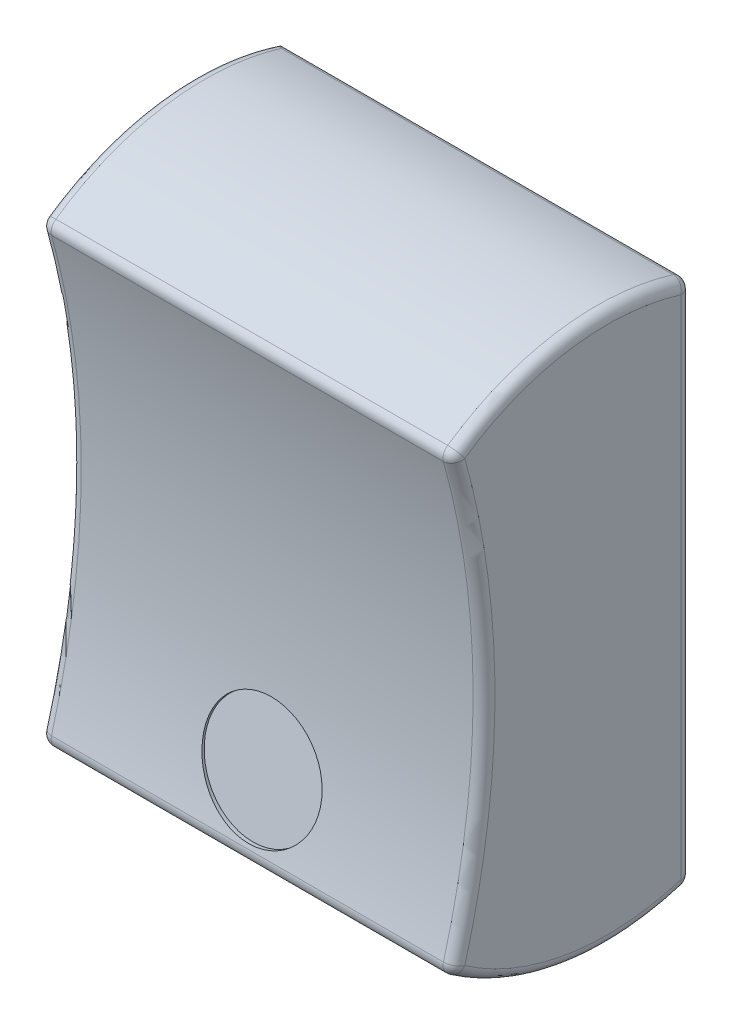
ISO-10303-21;
HEADER;
FILE_DESCRIPTION(('STEP AP214'),'2;1');
FILE_NAME('part.step','',(''),(''),'','','');
FILE_SCHEMA(('AUTOMOTIVE_DESIGN { 1 0 10303 214 1 1 1 1 }'));
ENDSEC;
DATA;
#1=APPLICATION_CONTEXT('core data for automotive mechanical design processes');
#2=APPLICATION_PROTOCOL_DEFINITION('international standard','automotive_design',2000,#1);
#3=PRODUCT_CONTEXT('',#1,'mechanical');
#4=PRODUCT('Part','Part','',(#3));
#5=PRODUCT_RELATED_PRODUCT_CATEGORY('part','',(#4));
#6=PRODUCT_DEFINITION_FORMATION('','',#4);
#7=PRODUCT_DEFINITION_CONTEXT('part definition',#1,'design');
#8=PRODUCT_DEFINITION('design','',#6,#7);
#9=PRODUCT_DEFINITION_SHAPE('','',#8);
#10=(LENGTH_UNIT() NAMED_UNIT(*) SI_UNIT(.MILLI.,.METRE.));
#11=(NAMED_UNIT(*) PLANE_ANGLE_UNIT() SI_UNIT($,.RADIAN.));
#12=(NAMED_UNIT(*) SI_UNIT($,.STERADIAN.) SOLID_ANGLE_UNIT());
#13=UNCERTAINTY_MEASURE_WITH_UNIT(LENGTH_MEASURE(1.E-05),#10,'distance_accuracy_value','');
#14=(GEOMETRIC_REPRESENTATION_CONTEXT(3) GLOBAL_UNCERTAINTY_ASSIGNED_CONTEXT((#13)) GLOBAL_UNIT_ASSIGNED_CONTEXT((#10,
#11,#12)) REPRESENTATION_CONTEXT('',''));
#15=CARTESIAN_POINT('',(0.,0.,0.));
#16=DIRECTION('',(0.,0.,1.));
#17=DIRECTION('',(1.,0.,0.));
#18=AXIS2_PLACEMENT_3D('',#15,#16,#17);
#19=CARTESIAN_POINT('',(9.5,0.,46.5403418666731));
#20=DIRECTION('',(-1.,0.,0.));
#21=DIRECTION('',(0.,0.,1.));
#22=AXIS2_PLACEMENT_3D('',#19,#20,#21);
#23=CYLINDRICAL_SURFACE('',#22,36.9999999999999);
#24=DIRECTION('',(-1.,0.,0.));
#25=VECTOR('',#24,1.);
#26=CARTESIAN_POINT('',(9.5,9.95392788031332,10.9044144933956));
#27=LINE('',#26,#25);
#28=CARTESIAN_POINT('',(9.,9.95392788031332,10.9044144933956));
#29=VERTEX_POINT('',#28);
#30=CARTESIAN_POINT('',(-9.,9.95392788031332,10.9044144933956));
#31=VERTEX_POINT('',#30);
#32=EDGE_CURVE('E257',#29,#31,#27,.T.);
#33=ORIENTED_EDGE('',*,*,#32,.T.);
#34=CARTESIAN_POINT('',(-9.,0.,46.5403418666731));
#35=DIRECTION('',(1.,0.,0.));
#36=DIRECTION('',(0.,0.,-1.));
#37=AXIS2_PLACEMENT_3D('',#34,#35,#36);
#38=CIRCLE('',#37,36.9999999999999);
#39=CARTESIAN_POINT('',(-9.,-9.95392788031332,10.9044144933956));
#40=VERTEX_POINT('',#39);
#41=EDGE_CURVE('E293',#31,#40,#38,.F.);
#42=ORIENTED_EDGE('',*,*,#41,.T.);
#43=DIRECTION('',(-1.,0.,0.));
#44=VECTOR('',#43,1.);
#45=CARTESIAN_POINT('',(9.5,-9.95392788031332,10.9044144933956));
#46=LINE('',#45,#44);
#47=CARTESIAN_POINT('',(9.,-9.95392788031332,10.9044144933956));
#48=VERTEX_POINT('',#47);
#49=EDGE_CURVE('E299',#40,#48,#46,.F.);
#50=ORIENTED_EDGE('',*,*,#49,.T.);
#51=CARTESIAN_POINT('',(9.,0.,46.5403418666731));
#52=DIRECTION('',(1.,0.,0.));
#53=DIRECTION('',(0.,0.,-1.));
#54=AXIS2_PLACEMENT_3D('',#51,#52,#53);
#55=CIRCLE('',#54,36.9999999999999);
#56=EDGE_CURVE('E304',#48,#29,#55,.T.);
#57=ORIENTED_EDGE('',*,*,#56,.T.);
#58=EDGE_LOOP('',(#33,#42,#50,#57));
#59=FACE_BOUND('',#58,.T.);
#60=CARTESIAN_POINT('',(0.,-4.44808845911152,9.80868645802175));
#61=CARTESIAN_POINT('',(-0.152015556943355,-4.44809525060015,9.80868644265864));
#62=CARTESIAN_POINT('',(-0.304136129508207,-4.46086310683319,9.81022644787345));
#63=CARTESIAN_POINT('',(-0.604173119909223,-4.51159644231174,9.81642424573123));
#64=CARTESIAN_POINT('',(-0.752084502984961,-4.54959087532301,9.82108562097456));
#65=CARTESIAN_POINT('',(-1.03931423980043,-4.64963307637608,9.83361988462219));
#66=CARTESIAN_POINT('',(-1.17863720982043,-4.71166778975028,9.84149103013613));
#67=CARTESIAN_POINT('',(-1.4447973719315,-4.85794009069451,9.8605677158941));
#68=CARTESIAN_POINT('',(-1.57163732934071,-4.9421727455575,9.87177251542275));
#69=CARTESIAN_POINT('',(-1.80951035033081,-5.13054299957085,9.89765425521252));
#70=CARTESIAN_POINT('',(-1.92051609474946,-5.23471429139984,9.91233708283358));
#71=CARTESIAN_POINT('',(-2.12333484463515,-5.45984269862248,9.94521880960401));
#72=CARTESIAN_POINT('',(-2.21514704445616,-5.58080051827359,9.96341785628446));
#73=CARTESIAN_POINT('',(-2.37705392123047,-5.83612943984643,10.00328834679));
#74=CARTESIAN_POINT('',(-2.44712685384906,-5.97051379499978,10.0249632346153));
#75=CARTESIAN_POINT('',(-2.56342543902181,-6.24871131515531,10.0715404477602));
#76=CARTESIAN_POINT('',(-2.60965142993638,-6.39252434634288,10.0964427272807));
#77=CARTESIAN_POINT('',(-2.67686360394062,-6.68516526709477,10.1489883155522));
#78=CARTESIAN_POINT('',(-2.69789573794512,-6.83398351622424,10.1766265342148));
#79=CARTESIAN_POINT('',(-2.714266959859,-7.13261990896966,10.2340221863179));
#80=CARTESIAN_POINT('',(-2.70960641390347,-7.28243803830636,10.2637795895529));
#81=CARTESIAN_POINT('',(-2.67476196822029,-7.5785401737478,10.3244815975073));
#82=CARTESIAN_POINT('',(-2.64462457457549,-7.72483012016232,10.3554239410169));
#83=CARTESIAN_POINT('',(-2.55975595999252,-8.01005191882634,10.4174905885844));
#84=CARTESIAN_POINT('',(-2.50502453211178,-8.14898370915083,10.4486148941712));
#85=CARTESIAN_POINT('',(-2.37245876691253,-8.41577647942333,10.5098897264812));
#86=CARTESIAN_POINT('',(-2.2945996195063,-8.54362537904411,10.5400391687165));
#87=CARTESIAN_POINT('',(-2.11800673361776,-8.78457026515896,10.5980727748488));
#88=CARTESIAN_POINT('',(-2.01927266330858,-8.89766601709142,10.6259569027266));
#89=CARTESIAN_POINT('',(-1.80345210296187,-9.10626516015082,10.678279005717));
#90=CARTESIAN_POINT('',(-1.68632251530952,-9.20172606301772,10.7027086254169));
#91=CARTESIAN_POINT('',(-1.43718606518732,-9.37210947287514,10.7468880471571));
#92=CARTESIAN_POINT('',(-1.30517920100864,-9.4470319775066,10.7666378486598));
#93=CARTESIAN_POINT('',(-1.03001894469917,-9.57428259063133,10.8004835898333));
#94=CARTESIAN_POINT('',(-0.886865570119078,-9.62661073469959,10.8145795384062));
#95=CARTESIAN_POINT('',(-0.593479470761656,-9.70722669783235,10.8363993784729));
#96=CARTESIAN_POINT('',(-0.443246866399587,-9.73551492565185,10.8441233783102));
#97=CARTESIAN_POINT('',(-0.140360394345807,-9.767227905553,10.8527875349199));
#98=CARTESIAN_POINT('',(0.01228664965757,-9.77071332363588,10.8537442439951));
#99=CARTESIAN_POINT('',(0.316014915337675,-9.75288475267661,10.848867799272));
#100=CARTESIAN_POINT('',(0.467096148819073,-9.73157095073358,10.8430346966997));
#101=CARTESIAN_POINT('',(0.763227850254708,-9.66477279669679,10.8248921282107));
#102=CARTESIAN_POINT('',(0.908285042253417,-9.61931621978623,10.8125901046597));
#103=CARTESIAN_POINT('',(1.18845885076849,-9.50549802910248,10.7821406031121));
#104=CARTESIAN_POINT('',(1.32357533984614,-9.43713612174786,10.7639930501927));
#105=CARTESIAN_POINT('',(1.58031667897601,-9.27922092876062,10.722710638141));
#106=CARTESIAN_POINT('',(1.70191517787422,-9.18962728370865,10.6995662881418));
#107=CARTESIAN_POINT('',(1.92790336612723,-8.99176249300466,10.6494154871162));
#108=CARTESIAN_POINT('',(2.0322928123963,-8.88349108356489,10.6224089815452));
#109=CARTESIAN_POINT('',(2.2211153458737,-8.65098822226591,10.5657018710021));
#110=CARTESIAN_POINT('',(2.30550730367577,-8.5267246746793,10.535995884485));
#111=CARTESIAN_POINT('',(2.45165844769029,-8.26583827416514,10.4752086664971));
#112=CARTESIAN_POINT('',(2.51341780499535,-8.1292155146776,10.4441274454244));
#113=CARTESIAN_POINT('',(2.61248645944786,-7.84754884156255,10.381847093604));
#114=CARTESIAN_POINT('',(2.64981849171264,-7.70251289559046,10.3506480997553));
#115=CARTESIAN_POINT('',(2.69904467209305,-7.40798883524168,10.2892133201758));
#116=CARTESIAN_POINT('',(2.7109391894394,-7.25850078552012,10.2589775204703));
#117=CARTESIAN_POINT('',(2.70894720597966,-6.95968594935933,10.2004753908988));
#118=CARTESIAN_POINT('',(2.69512262096389,-6.81035963931783,10.1722045006727));
#119=CARTESIAN_POINT('',(2.64221179726008,-6.5157672875727,10.1182715043715));
#120=CARTESIAN_POINT('',(2.60312553748594,-6.37050124925832,10.092609400474));
#121=CARTESIAN_POINT('',(2.50082095281403,-6.08821115037746,10.0443941039583));
#122=CARTESIAN_POINT('',(2.43760632005091,-5.95118583252379,10.021840436404));
#123=CARTESIAN_POINT('',(2.28884631687341,-5.68928525421434,9.98012250292847));
#124=CARTESIAN_POINT('',(2.20330142829003,-5.56440973167619,9.96095816388891));
#125=CARTESIAN_POINT('',(2.01209137358601,-5.33014234597086,9.92608694419314));
#126=CARTESIAN_POINT('',(1.90638338007253,-5.22078432089494,9.91038757924886));
#127=CARTESIAN_POINT('',(1.6779167298577,-5.02102049282121,9.88247019252027));
#128=CARTESIAN_POINT('',(1.55515392521305,-4.9306193138283,9.87025301986122));
#129=CARTESIAN_POINT('',(1.29586957269183,-4.77132440534398,9.84918557577692));
#130=CARTESIAN_POINT('',(1.15932644897268,-4.70246511721388,9.84034069110691));
#131=CARTESIAN_POINT('',(0.876610844509663,-4.58855456158713,9.82592379474927));
#132=CARTESIAN_POINT('',(0.730449754615653,-4.54347568132618,9.82034798631183));
#133=CARTESIAN_POINT('',(0.486175222792701,-4.49005835182255,9.81378760025324));
#134=CARTESIAN_POINT('',(0.389636308443979,-4.47434095964172,9.81187352904765));
#135=CARTESIAN_POINT('',(0.195412728845136,-4.45335384008068,9.80932296407563));
#136=CARTESIAN_POINT('',(0.0977280657574028,-4.4480840929857,9.80868646789841));
#137=CARTESIAN_POINT('',(0.,-4.44808845911152,9.80868645802175));
#138=B_SPLINE_CURVE_WITH_KNOTS('',3,(#60,#61,#62,#63,#64,#65,#66,#67,#68,#69,#70,#71,#72,#73,
#74,#75,#76,#77,#78,#79,#80,#81,#82,#83,#84,#85,#86,#87,#88,#89,#90,#91,#92,#93,#94,#95,#96,#97,
#98,#99,#100,#101,#102,#103,#104,#105,#106,#107,#108,#109,#110,#111,#112,#113,#114,#115,#116,
#117,#118,#119,#120,#121,#122,#123,#124,#125,#126,#127,#128,#129,#130,#131,#132,#133,#134,#135,
#136,#137),.UNSPECIFIED.,.T.,.F.,(4,2,2,2,2,2,2,2,2,2,2,2,2,2,2,2,2,2,2,2,2,2,2,2,2,2,2,2,2,2,2,
2,2,2,2,2,2,2,4),(0.,0.455689909184982,0.911903741992222,1.36787018196135,1.8237353848352,
2.28037782893465,2.73703943668276,3.19415635069705,3.6512667785748,4.10754221001236,
4.56381113928601,5.01924897772555,5.47469064844592,5.93062266615306,6.38656193188066,
6.84358577533224,7.30060967127818,7.75763284763386,8.21464825298715,8.67054544403321,
9.12643919555954,9.58180959419649,10.0371858296148,10.4934347334123,10.949690081382,
11.4068758322503,11.8640581269218,12.3208143031413,12.7775638494066,13.2332152461164,
13.6888670231623,14.1444491040998,14.6000213555292,15.0565722622419,15.5132344028727,
15.9706229709915,16.4274792640463,16.720434658487,17.0133895001182),.UNSPECIFIED.);
#139=CARTESIAN_POINT('',(0.,-4.44808845911152,9.80868645802175));
#140=VERTEX_POINT('',#139);
#141=EDGE_CURVE('E37',#140,#140,#138,.T.);
#142=ORIENTED_EDGE('',*,*,#141,.F.);
#143=EDGE_LOOP('',(#142));
#144=FACE_BOUND('',#143,.T.);
#145=ADVANCED_FACE('F33',(#59,#144),#23,.F.);
#146=CARTESIAN_POINT('',(9.5,-0.640134880450685,3.86697096777915));
#147=DIRECTION('',(-1.,0.,0.));
#148=DIRECTION('',(0.,0.,1.));
#149=AXIS2_PLACEMENT_3D('',#146,#147,#148);
#150=CYLINDRICAL_SURFACE('',#149,12.);
#151=DIRECTION('',(-1.,0.,0.));
#152=VECTOR('',#151,1.);
#153=CARTESIAN_POINT('',(9.5,-10.4992363122272,10.7078860350742));
#154=LINE('',#153,#152);
#155=CARTESIAN_POINT('',(9.,-10.4992363122272,10.7078860350742));
#156=VERTEX_POINT('',#155);
#157=CARTESIAN_POINT('',(-9.,-10.4992363122272,10.7078860350742));
#158=VERTEX_POINT('',#157);
#159=EDGE_CURVE('E311',#156,#158,#154,.T.);
#160=ORIENTED_EDGE('',*,*,#159,.T.);
#161=CARTESIAN_POINT('',(-9.,-0.640134880450685,3.86697096777915));
#162=DIRECTION('',(1.,0.,0.));
#163=DIRECTION('',(0.,0.,-1.));
#164=AXIS2_PLACEMENT_3D('',#161,#162,#163);
#165=CIRCLE('',#164,12.);
#166=CARTESIAN_POINT('',(-9.,-12.1142925582247,0.353609957922643));
#167=VERTEX_POINT('',#166);
#168=EDGE_CURVE('E306',#158,#167,#165,.T.);
#169=ORIENTED_EDGE('',*,*,#168,.T.);
#170=DIRECTION('',(-1.,0.,0.));
#171=VECTOR('',#170,1.);
#172=CARTESIAN_POINT('',(9.5,-12.1142925582247,0.353609957922643));
#173=LINE('',#172,#171);
#174=CARTESIAN_POINT('',(9.,-12.1142925582247,0.353609957922643));
#175=VERTEX_POINT('',#174);
#176=EDGE_CURVE('E308',#167,#175,#173,.F.);
#177=ORIENTED_EDGE('',*,*,#176,.T.);
#178=CARTESIAN_POINT('',(9.,-0.640134880450685,3.86697096777915));
#179=DIRECTION('',(1.,0.,0.));
#180=DIRECTION('',(0.,0.,-1.));
#181=AXIS2_PLACEMENT_3D('',#178,#179,#180);
#182=CIRCLE('',#181,12.);
#183=EDGE_CURVE('E138',#175,#156,#182,.F.);
#184=ORIENTED_EDGE('',*,*,#183,.T.);
#185=EDGE_LOOP('',(#160,#169,#177,#184));
#186=FACE_BOUND('',#185,.T.);
#187=ADVANCED_FACE('F324',(#186),#150,.T.);
#188=CARTESIAN_POINT('',(9.5,12.,0.));
#189=DIRECTION('',(0.,0.,1.));
#190=DIRECTION('',(0.,-1.,0.));
#191=AXIS2_PLACEMENT_3D('',#188,#189,#190);
#192=PLANE('',#191);
#193=DIRECTION('',(-1.,0.,0.));
#194=VECTOR('',#193,1.);
#195=CARTESIAN_POINT('',(9.5,-11.6362026549841,0.));
#196=LINE('',#195,#194);
#197=CARTESIAN_POINT('',(9.,-11.6362026549841,0.));
#198=VERTEX_POINT('',#197);
#199=CARTESIAN_POINT('',(-9.47497571321353,-11.6362026549841,0.));
#200=VERTEX_POINT('',#199);
#201=EDGE_CURVE('E134',#198,#200,#196,.T.);
#202=ORIENTED_EDGE('',*,*,#201,.T.);
#203=CARTESIAN_POINT('',(-9.47497571321353,-11.6362026549841,0.));
#204=CARTESIAN_POINT('',(-9.4833057981733,-11.6092114088466,0.));
#205=CARTESIAN_POINT('',(-9.48955619791181,-11.5819061148948,0.));
#206=CARTESIAN_POINT('',(-9.49789758816027,-11.5266676882119,0.));
#207=CARTESIAN_POINT('',(-9.49998861735058,-11.4987345613218,0.));
#208=CARTESIAN_POINT('',(-9.5,-11.4704873924585,0.));
#209=B_SPLINE_CURVE_WITH_KNOTS('',3,(#203,#204,#205,#206,#207,#208),.UNSPECIFIED.,.F.,.F.,(4,2,
4),(0.,0.0840346307910023,0.168068480092202),.UNSPECIFIED.);
#210=CARTESIAN_POINT('',(-9.5,-11.4704873924585,0.));
#211=VERTEX_POINT('',#210);
#212=EDGE_CURVE('E128',#200,#211,#209,.T.);
#213=ORIENTED_EDGE('',*,*,#212,.T.);
#214=DIRECTION('',(0.,1.,0.));
#215=VECTOR('',#214,1.);
#216=CARTESIAN_POINT('',(-9.5,12.,0.));
#217=LINE('',#216,#215);
#218=CARTESIAN_POINT('',(-9.5,11.4704873924585,0.));
#219=VERTEX_POINT('',#218);
#220=EDGE_CURVE('E131',#211,#219,#217,.T.);
#221=ORIENTED_EDGE('',*,*,#220,.T.);
#222=CARTESIAN_POINT('',(-9.5,11.4704873924585,0.));
#223=CARTESIAN_POINT('',(-9.49998861735058,11.4987345613218,0.));
#224=CARTESIAN_POINT('',(-9.49789758816027,11.5266676882119,0.));
#225=CARTESIAN_POINT('',(-9.48955619791181,11.5819061148948,0.));
#226=CARTESIAN_POINT('',(-9.4833057981733,11.6092114088466,0.));
#227=CARTESIAN_POINT('',(-9.47497571321353,11.6362026549841,0.));
#228=B_SPLINE_CURVE_WITH_KNOTS('',3,(#222,#223,#224,#225,#226,#227),.UNSPECIFIED.,.F.,.F.,(4,2,
4),(0.,0.084033849301201,0.168068480092204),.UNSPECIFIED.);
#229=CARTESIAN_POINT('',(-9.47497571321353,11.6362026549841,0.));
#230=VERTEX_POINT('',#229);
#231=EDGE_CURVE('E146',#219,#230,#228,.T.);
#232=ORIENTED_EDGE('',*,*,#231,.T.);
#233=DIRECTION('',(-1.,0.,0.));
#234=VECTOR('',#233,1.);
#235=CARTESIAN_POINT('',(9.5,11.6362026549841,0.));
#236=LINE('',#235,#234);
#237=CARTESIAN_POINT('',(9.,11.6362026549841,0.));
#238=VERTEX_POINT('',#237);
#239=EDGE_CURVE('E332',#230,#238,#236,.F.);
#240=ORIENTED_EDGE('',*,*,#239,.T.);
#241=DIRECTION('',(0.,1.,0.));
#242=VECTOR('',#241,1.);
#243=CARTESIAN_POINT('',(9.,-12.,0.));
#244=LINE('',#243,#242);
#245=EDGE_CURVE('E334',#238,#198,#244,.F.);
#246=ORIENTED_EDGE('',*,*,#245,.T.);
#247=EDGE_LOOP('',(#202,#213,#221,#232,#240,#246));
#248=FACE_BOUND('',#247,.T.);
#249=ADVANCED_FACE('F130',(#248),#192,.F.);
#250=CARTESIAN_POINT('',(9.5,0.640134880450685,3.86697096777915));
#251=DIRECTION('',(-1.,0.,0.));
#252=DIRECTION('',(0.,0.,1.));
#253=AXIS2_PLACEMENT_3D('',#250,#251,#252);
#254=CYLINDRICAL_SURFACE('',#253,12.);
#255=DIRECTION('',(-1.,0.,0.));
#256=VECTOR('',#255,1.);
#257=CARTESIAN_POINT('',(9.5,10.4992363122272,10.7078860350742));
#258=LINE('',#257,#256);
#259=CARTESIAN_POINT('',(-9.,10.4992363122272,10.7078860350742));
#260=VERTEX_POINT('',#259);
#261=CARTESIAN_POINT('',(9.,10.4992363122272,10.7078860350742));
#262=VERTEX_POINT('',#261);
#263=EDGE_CURVE('E58',#260,#262,#258,.F.);
#264=ORIENTED_EDGE('',*,*,#263,.T.);
#265=CARTESIAN_POINT('',(9.,0.640134880450685,3.86697096777915));
#266=DIRECTION('',(1.,0.,0.));
#267=DIRECTION('',(0.,0.,-1.));
#268=AXIS2_PLACEMENT_3D('',#265,#266,#267);
#269=CIRCLE('',#268,12.);
#270=CARTESIAN_POINT('',(9.,12.1142925582247,0.353609957922638));
#271=VERTEX_POINT('',#270);
#272=EDGE_CURVE('E11',#262,#271,#269,.F.);
#273=ORIENTED_EDGE('',*,*,#272,.T.);
#274=DIRECTION('',(-1.,0.,0.));
#275=VECTOR('',#274,1.);
#276=CARTESIAN_POINT('',(9.5,12.1142925582247,0.353609957922638));
#277=LINE('',#276,#275);
#278=CARTESIAN_POINT('',(-9.,12.1142925582247,0.353609957922638));
#279=VERTEX_POINT('',#278);
#280=EDGE_CURVE('E47',#271,#279,#277,.T.);
#281=ORIENTED_EDGE('',*,*,#280,.T.);
#282=CARTESIAN_POINT('',(-9.,0.640134880450685,3.86697096777915));
#283=DIRECTION('',(1.,0.,0.));
#284=DIRECTION('',(0.,0.,-1.));
#285=AXIS2_PLACEMENT_3D('',#282,#283,#284);
#286=CIRCLE('',#285,12.);
#287=EDGE_CURVE('E168',#279,#260,#286,.T.);
#288=ORIENTED_EDGE('',*,*,#287,.T.);
#289=EDGE_LOOP('',(#264,#273,#281,#288));
#290=FACE_BOUND('',#289,.T.);
#291=ADVANCED_FACE('F323',(#290),#254,.T.);
#292=CARTESIAN_POINT('',(9.5,-0.640134880450685,3.86697096777915));
#293=DIRECTION('',(1.,0.,0.));
#294=DIRECTION('',(0.,0.,-1.));
#295=AXIS2_PLACEMENT_3D('',#292,#293,#294);
#296=PLANE('',#295);
#297=CARTESIAN_POINT('',(9.5,0.,46.5403418666731));
#298=DIRECTION('',(1.,0.,0.));
#299=DIRECTION('',(0.,0.,-1.));
#300=AXIS2_PLACEMENT_3D('',#297,#298,#299);
#301=CIRCLE('',#300,37.4999999999999);
#302=CARTESIAN_POINT('',(9.5,10.0884404192365,10.4228479072702));
#303=VERTEX_POINT('',#302);
#304=CARTESIAN_POINT('',(9.5,-10.0884404192365,10.4228479072702));
#305=VERTEX_POINT('',#304);
#306=EDGE_CURVE('E154',#303,#305,#301,.F.);
#307=ORIENTED_EDGE('',*,*,#306,.T.);
#308=CARTESIAN_POINT('',(9.5,-0.640134880450685,3.86697096777915));
#309=DIRECTION('',(1.,0.,0.));
#310=DIRECTION('',(0.,0.,-1.));
#311=AXIS2_PLACEMENT_3D('',#308,#309,#310);
#312=CIRCLE('',#311,11.5);
#313=CARTESIAN_POINT('',(9.5,-11.6362026549841,0.499999999999997));
#314=VERTEX_POINT('',#313);
#315=EDGE_CURVE('E165',#305,#314,#312,.T.);
#316=ORIENTED_EDGE('',*,*,#315,.T.);
#317=DIRECTION('',(0.,1.,0.));
#318=VECTOR('',#317,1.);
#319=CARTESIAN_POINT('',(9.5,12.,0.499999999999992));
#320=LINE('',#319,#318);
#321=CARTESIAN_POINT('',(9.5,11.6362026549841,0.499999999999993));
#322=VERTEX_POINT('',#321);
#323=EDGE_CURVE('E163',#314,#322,#320,.T.);
#324=ORIENTED_EDGE('',*,*,#323,.T.);
#325=CARTESIAN_POINT('',(9.5,0.640134880450685,3.86697096777915));
#326=DIRECTION('',(1.,0.,0.));
#327=DIRECTION('',(0.,0.,-1.));
#328=AXIS2_PLACEMENT_3D('',#325,#326,#327);
#329=CIRCLE('',#328,11.5);
#330=EDGE_CURVE('E156',#322,#303,#329,.T.);
#331=ORIENTED_EDGE('',*,*,#330,.T.);
#332=EDGE_LOOP('',(#307,#316,#324,#331));
#333=FACE_BOUND('',#332,.T.);
#334=ADVANCED_FACE('F381',(#333),#296,.T.);
#335=CARTESIAN_POINT('',(-9.5,-0.640134880450685,3.86697096777915));
#336=DIRECTION('',(1.,0.,0.));
#337=DIRECTION('',(0.,0.,-1.));
#338=AXIS2_PLACEMENT_3D('',#335,#336,#337);
#339=PLANE('',#338);
#340=ORIENTED_EDGE('',*,*,#220,.F.);
#341=CARTESIAN_POINT('',(-9.5,-0.640134880450685,3.86697096777915));
#342=DIRECTION('',(1.,0.,0.));
#343=DIRECTION('',(0.,0.,-1.));
#344=AXIS2_PLACEMENT_3D('',#341,#342,#343);
#345=CIRCLE('',#344,11.5);
#346=CARTESIAN_POINT('',(-9.5,-10.0884404192365,10.4228479072702));
#347=VERTEX_POINT('',#346);
#348=EDGE_CURVE('E142',#211,#347,#345,.F.);
#349=ORIENTED_EDGE('',*,*,#348,.T.);
#350=CARTESIAN_POINT('',(-9.5,0.,46.5403418666731));
#351=DIRECTION('',(1.,0.,0.));
#352=DIRECTION('',(0.,0.,-1.));
#353=AXIS2_PLACEMENT_3D('',#350,#351,#352);
#354=CIRCLE('',#353,37.4999999999999);
#355=CARTESIAN_POINT('',(-9.5,10.0884404192365,10.4228479072702));
#356=VERTEX_POINT('',#355);
#357=EDGE_CURVE('E158',#347,#356,#354,.T.);
#358=ORIENTED_EDGE('',*,*,#357,.T.);
#359=CARTESIAN_POINT('',(-9.5,0.640134880450685,3.86697096777915));
#360=DIRECTION('',(1.,0.,0.));
#361=DIRECTION('',(0.,0.,-1.));
#362=AXIS2_PLACEMENT_3D('',#359,#360,#361);
#363=CIRCLE('',#362,11.5);
#364=EDGE_CURVE('E145',#356,#219,#363,.F.);
#365=ORIENTED_EDGE('',*,*,#364,.T.);
#366=EDGE_LOOP('',(#340,#349,#358,#365));
#367=FACE_BOUND('',#366,.T.);
#368=ADVANCED_FACE('F141',(#367),#339,.F.);
#369=CARTESIAN_POINT('',(9.,10.0884404192365,10.4228479072702));
#370=DIRECTION('',(0.,0.,1.));
#371=DIRECTION('',(1.,0.,0.));
#372=AXIS2_PLACEMENT_3D('',#369,#370,#371);
#373=SPHERICAL_SURFACE('',#372,0.5);
#374=CARTESIAN_POINT('',(9.,10.0884404192365,10.4228479072702));
#375=DIRECTION('',(0.,-0.570076255607922,0.821591785981366));
#376=DIRECTION('',(0.,-0.821591785981366,-0.570076255607922));
#377=AXIS2_PLACEMENT_3D('',#374,#375,#376);
#378=CIRCLE('',#377,0.5);
#379=EDGE_CURVE('E243',#262,#303,#378,.F.);
#380=ORIENTED_EDGE('',*,*,#379,.F.);
#381=CARTESIAN_POINT('',(9.,10.0884404192365,10.4228479072702));
#382=DIRECTION('',(1.,0.,0.));
#383=DIRECTION('',(0.,0.,-1.));
#384=AXIS2_PLACEMENT_3D('',#381,#382,#383);
#385=CIRCLE('',#384,0.5);
#386=EDGE_CURVE('E147',#29,#262,#385,.F.);
#387=ORIENTED_EDGE('',*,*,#386,.F.);
#388=CARTESIAN_POINT('',(9.,10.0884404192365,10.4228479072702));
#389=DIRECTION('',(0.,0.963133172250747,0.269025077846309));
#390=DIRECTION('',(0.,-0.269025077846309,0.963133172250747));
#391=AXIS2_PLACEMENT_3D('',#388,#389,#390);
#392=CIRCLE('',#391,0.5);
#393=EDGE_CURVE('E248',#303,#29,#392,.F.);
#394=ORIENTED_EDGE('',*,*,#393,.F.);
#395=EDGE_LOOP('',(#380,#387,#394));
#396=FACE_BOUND('',#395,.T.);
#397=ADVANCED_FACE('F35',(#396),#373,.T.);
#398=CARTESIAN_POINT('',(-9.,0.640134880450685,3.86697096777915));
#399=DIRECTION('',(1.,0.,0.));
#400=DIRECTION('',(0.,0.,-1.));
#401=AXIS2_PLACEMENT_3D('',#398,#399,#400);
#402=TOROIDAL_SURFACE('',#401,11.5,0.5);
#403=CARTESIAN_POINT('',(-9.,10.0884404192365,10.4228479072702));
#404=DIRECTION('',(0.,-0.570076255607916,0.82159178598137));
#405=DIRECTION('',(0.,-0.821591785981371,-0.570076255607916));
#406=AXIS2_PLACEMENT_3D('',#403,#404,#405);
#407=CIRCLE('',#406,0.5);
#408=EDGE_CURVE('E244',#260,#356,#407,.T.);
#409=ORIENTED_EDGE('',*,*,#408,.F.);
#410=ORIENTED_EDGE('',*,*,#287,.F.);
#411=CARTESIAN_POINT('',(-9.47497571321353,11.6362026549841,0.));
#412=CARTESIAN_POINT('',(-9.46640399746119,11.6638253431885,-9.01411803888831E-07));
#413=CARTESIAN_POINT('',(-9.45595117015493,11.6906756128574,0.0022838511441019));
#414=CARTESIAN_POINT('',(-9.43222184747509,11.7421295878081,0.0106639742724501));
#415=CARTESIAN_POINT('',(-9.41897751307457,11.7667546673001,0.0167173591901579));
#416=CARTESIAN_POINT('',(-9.38681108403796,11.8195364690071,0.033801365125701));
#417=CARTESIAN_POINT('',(-9.36729698769206,11.8470401387613,0.0456972675888329));
#418=CARTESIAN_POINT('',(-9.3259701345595,11.8983675575789,0.0732415702032547));
#419=CARTESIAN_POINT('',(-9.30414531613349,11.9221702173033,0.0889102654175269));
#420=CARTESIAN_POINT('',(-9.25137166497688,11.9733924407981,0.128936412956604));
#421=CARTESIAN_POINT('',(-9.21983531756776,11.9993084615302,0.154439577995976));
#422=CARTESIAN_POINT('',(-9.15539930676128,12.0444321561339,0.209131444127782));
#423=CARTESIAN_POINT('',(-9.12250161737336,12.0636491871492,0.238314926281056));
#424=CARTESIAN_POINT('',(-9.06074074419095,12.0932753962198,0.295155870215498));
#425=CARTESIAN_POINT('',(-9.03195778952144,12.1045411953344,0.322454638209022));
#426=CARTESIAN_POINT('',(-9.00213046214546,12.1136519862499,0.351530080206579));
#427=CARTESIAN_POINT('',(-9.0010652104149,12.1139739747654,0.35256951981862));
#428=CARTESIAN_POINT('',(-9.,12.1142925582247,0.353609957922639));
#429=B_SPLINE_CURVE_WITH_KNOTS('',3,(#411,#412,#413,#414,#415,#416,#417,#418,#419,#420,#421,
#422,#423,#424,#425,#426,#427,#428),.UNSPECIFIED.,.F.,.F.,(4,2,2,2,2,2,2,2,4),(0.,
0.0863432253840962,0.171741318086226,0.278458713028091,0.385763530322396,0.529395344608982,
0.672825722541247,0.796168502398627,0.800736836754504),.UNSPECIFIED.);
#430=EDGE_CURVE('E236',#230,#279,#429,.T.);
#431=ORIENTED_EDGE('',*,*,#430,.F.);
#432=ORIENTED_EDGE('',*,*,#231,.F.);
#433=ORIENTED_EDGE('',*,*,#364,.F.);
#434=EDGE_LOOP('',(#409,#410,#431,#432,#433));
#435=FACE_BOUND('',#434,.T.);
#436=ADVANCED_FACE('F232',(#435),#402,.T.);
#437=CARTESIAN_POINT('',(9.5,10.0884404192365,10.4228479072702));
#438=DIRECTION('',(1.,0.,0.));
#439=DIRECTION('',(0.,0.,-1.));
#440=AXIS2_PLACEMENT_3D('',#437,#438,#439);
#441=CYLINDRICAL_SURFACE('',#440,0.5);
#442=ORIENTED_EDGE('',*,*,#386,.T.);
#443=ORIENTED_EDGE('',*,*,#263,.F.);
#444=CARTESIAN_POINT('',(-9.,10.0884404192365,10.4228479072702));
#445=DIRECTION('',(-1.,0.,0.));
#446=DIRECTION('',(0.,0.,1.));
#447=AXIS2_PLACEMENT_3D('',#444,#445,#446);
#448=CIRCLE('',#447,0.5);
#449=EDGE_CURVE('E284',#31,#260,#448,.T.);
#450=ORIENTED_EDGE('',*,*,#449,.F.);
#451=ORIENTED_EDGE('',*,*,#32,.F.);
#452=EDGE_LOOP('',(#442,#443,#450,#451));
#453=FACE_BOUND('',#452,.T.);
#454=ADVANCED_FACE('F254',(#453),#441,.T.);
#455=CARTESIAN_POINT('',(9.,0.,46.5403418666731));
#456=DIRECTION('',(1.,0.,0.));
#457=DIRECTION('',(0.,0.,-1.));
#458=AXIS2_PLACEMENT_3D('',#455,#456,#457);
#459=TOROIDAL_SURFACE('',#458,37.4999999999999,0.5);
#460=ORIENTED_EDGE('',*,*,#393,.T.);
#461=ORIENTED_EDGE('',*,*,#56,.F.);
#462=CARTESIAN_POINT('',(9.,-10.0884404192365,10.4228479072702));
#463=DIRECTION('',(0.,-0.963133172250747,0.269025077846309));
#464=DIRECTION('',(0.,-0.269025077846309,-0.963133172250747));
#465=AXIS2_PLACEMENT_3D('',#462,#463,#464);
#466=CIRCLE('',#465,0.5);
#467=EDGE_CURVE('E269',#305,#48,#466,.T.);
#468=ORIENTED_EDGE('',*,*,#467,.F.);
#469=ORIENTED_EDGE('',*,*,#306,.F.);
#470=EDGE_LOOP('',(#460,#461,#468,#469));
#471=FACE_BOUND('',#470,.T.);
#472=ADVANCED_FACE('F362',(#471),#459,.T.);
#473=CARTESIAN_POINT('',(9.,0.640134880450685,3.86697096777915));
#474=DIRECTION('',(1.,0.,0.));
#475=DIRECTION('',(0.,0.,-1.));
#476=AXIS2_PLACEMENT_3D('',#473,#474,#475);
#477=TOROIDAL_SURFACE('',#476,11.5,0.5);
#478=ORIENTED_EDGE('',*,*,#379,.T.);
#479=ORIENTED_EDGE('',*,*,#330,.F.);
#480=CARTESIAN_POINT('',(9.,11.6362026549841,0.499999999999993));
#481=DIRECTION('',(0.,-0.292780084154708,-0.956179806481167));
#482=DIRECTION('',(0.,0.956179806481167,-0.292780084154708));
#483=AXIS2_PLACEMENT_3D('',#480,#481,#482);
#484=CIRCLE('',#483,0.5);
#485=EDGE_CURVE('E265',#271,#322,#484,.T.);
#486=ORIENTED_EDGE('',*,*,#485,.F.);
#487=ORIENTED_EDGE('',*,*,#272,.F.);
#488=EDGE_LOOP('',(#478,#479,#486,#487));
#489=FACE_BOUND('',#488,.T.);
#490=ADVANCED_FACE('F230',(#489),#477,.T.);
#491=CARTESIAN_POINT('',(9.5,11.6362026549841,0.499999999999993));
#492=DIRECTION('',(-1.,0.,0.));
#493=DIRECTION('',(0.,0.,1.));
#494=AXIS2_PLACEMENT_3D('',#491,#492,#493);
#495=CYLINDRICAL_SURFACE('',#494,0.5);
#496=ORIENTED_EDGE('',*,*,#430,.T.);
#497=ORIENTED_EDGE('',*,*,#280,.F.);
#498=CARTESIAN_POINT('',(9.,11.6362026549841,0.499999999999993));
#499=DIRECTION('',(1.,0.,0.));
#500=DIRECTION('',(0.,0.,-1.));
#501=AXIS2_PLACEMENT_3D('',#498,#499,#500);
#502=CIRCLE('',#501,0.5);
#503=EDGE_CURVE('E270',#238,#271,#502,.T.);
#504=ORIENTED_EDGE('',*,*,#503,.F.);
#505=ORIENTED_EDGE('',*,*,#239,.F.);
#506=EDGE_LOOP('',(#496,#497,#504,#505));
#507=FACE_BOUND('',#506,.T.);
#508=ADVANCED_FACE('F225',(#507),#495,.T.);
#509=CARTESIAN_POINT('',(-9.,10.0884404192365,10.4228479072702));
#510=DIRECTION('',(0.,0.,1.));
#511=DIRECTION('',(1.,0.,0.));
#512=AXIS2_PLACEMENT_3D('',#509,#510,#511);
#513=SPHERICAL_SURFACE('',#512,0.5);
#514=ORIENTED_EDGE('',*,*,#449,.T.);
#515=ORIENTED_EDGE('',*,*,#408,.T.);
#516=CARTESIAN_POINT('',(-9.,10.0884404192365,10.4228479072702));
#517=DIRECTION('',(0.,0.96313317225075,0.269025077846299));
#518=DIRECTION('',(0.,-0.269025077846299,0.96313317225075));
#519=AXIS2_PLACEMENT_3D('',#516,#517,#518);
#520=CIRCLE('',#519,0.5);
#521=EDGE_CURVE('E276',#31,#356,#520,.F.);
#522=ORIENTED_EDGE('',*,*,#521,.F.);
#523=EDGE_LOOP('',(#514,#515,#522));
#524=FACE_BOUND('',#523,.T.);
#525=ADVANCED_FACE('F221',(#524),#513,.T.);
#526=CARTESIAN_POINT('',(9.,-10.0884404192365,10.4228479072702));
#527=DIRECTION('',(0.,0.,1.));
#528=DIRECTION('',(1.,0.,0.));
#529=AXIS2_PLACEMENT_3D('',#526,#527,#528);
#530=SPHERICAL_SURFACE('',#529,0.5);
#531=CARTESIAN_POINT('',(9.,-10.0884404192365,10.4228479072702));
#532=DIRECTION('',(0.,0.570076255607916,0.82159178598137));
#533=DIRECTION('',(0.,-0.821591785981371,0.570076255607916));
#534=AXIS2_PLACEMENT_3D('',#531,#532,#533);
#535=CIRCLE('',#534,0.5);
#536=EDGE_CURVE('E355',#305,#156,#535,.F.);
#537=ORIENTED_EDGE('',*,*,#536,.F.);
#538=ORIENTED_EDGE('',*,*,#467,.T.);
#539=CARTESIAN_POINT('',(9.,-10.0884404192365,10.4228479072702));
#540=DIRECTION('',(1.,0.,0.));
#541=DIRECTION('',(0.,0.,-1.));
#542=AXIS2_PLACEMENT_3D('',#539,#540,#541);
#543=CIRCLE('',#542,0.5);
#544=EDGE_CURVE('E279',#156,#48,#543,.F.);
#545=ORIENTED_EDGE('',*,*,#544,.F.);
#546=EDGE_LOOP('',(#537,#538,#545));
#547=FACE_BOUND('',#546,.T.);
#548=ADVANCED_FACE('F217',(#547),#530,.T.);
#549=CARTESIAN_POINT('',(9.,11.6362026549841,0.499999999999993));
#550=DIRECTION('',(0.,0.,1.));
#551=DIRECTION('',(1.,0.,0.));
#552=AXIS2_PLACEMENT_3D('',#549,#550,#551);
#553=SPHERICAL_SURFACE('',#552,0.5);
#554=ORIENTED_EDGE('',*,*,#503,.T.);
#555=ORIENTED_EDGE('',*,*,#485,.T.);
#556=CARTESIAN_POINT('',(9.,11.6362026549841,0.499999999999993));
#557=DIRECTION('',(0.,1.,0.));
#558=DIRECTION('',(0.,0.,1.));
#559=AXIS2_PLACEMENT_3D('',#556,#557,#558);
#560=CIRCLE('',#559,0.5);
#561=EDGE_CURVE('E273',#238,#322,#560,.F.);
#562=ORIENTED_EDGE('',*,*,#561,.F.);
#563=EDGE_LOOP('',(#554,#555,#562));
#564=FACE_BOUND('',#563,.T.);
#565=ADVANCED_FACE('F213',(#564),#553,.T.);
#566=CARTESIAN_POINT('',(-9.,0.,46.5403418666731));
#567=DIRECTION('',(1.,0.,0.));
#568=DIRECTION('',(0.,0.,-1.));
#569=AXIS2_PLACEMENT_3D('',#566,#567,#568);
#570=TOROIDAL_SURFACE('',#569,37.4999999999999,0.5);
#571=ORIENTED_EDGE('',*,*,#521,.T.);
#572=ORIENTED_EDGE('',*,*,#357,.F.);
#573=CARTESIAN_POINT('',(-9.,-10.0884404192365,10.4228479072702));
#574=DIRECTION('',(0.,-0.963133172250747,0.269025077846309));
#575=DIRECTION('',(0.,-0.269025077846309,-0.963133172250747));
#576=AXIS2_PLACEMENT_3D('',#573,#574,#575);
#577=CIRCLE('',#576,0.5);
#578=EDGE_CURVE('E294',#40,#347,#577,.T.);
#579=ORIENTED_EDGE('',*,*,#578,.F.);
#580=ORIENTED_EDGE('',*,*,#41,.F.);
#581=EDGE_LOOP('',(#571,#572,#579,#580));
#582=FACE_BOUND('',#581,.T.);
#583=ADVANCED_FACE('F209',(#582),#570,.T.);
#584=CARTESIAN_POINT('',(9.5,-10.0884404192365,10.4228479072702));
#585=DIRECTION('',(1.,0.,0.));
#586=DIRECTION('',(0.,0.,-1.));
#587=AXIS2_PLACEMENT_3D('',#584,#585,#586);
#588=CYLINDRICAL_SURFACE('',#587,0.5);
#589=ORIENTED_EDGE('',*,*,#544,.T.);
#590=ORIENTED_EDGE('',*,*,#49,.F.);
#591=CARTESIAN_POINT('',(-9.,-10.0884404192365,10.4228479072702));
#592=DIRECTION('',(-1.,0.,0.));
#593=DIRECTION('',(0.,0.,1.));
#594=AXIS2_PLACEMENT_3D('',#591,#592,#593);
#595=CIRCLE('',#594,0.5);
#596=EDGE_CURVE('E349',#158,#40,#595,.T.);
#597=ORIENTED_EDGE('',*,*,#596,.F.);
#598=ORIENTED_EDGE('',*,*,#159,.F.);
#599=EDGE_LOOP('',(#589,#590,#597,#598));
#600=FACE_BOUND('',#599,.T.);
#601=ADVANCED_FACE('F205',(#600),#588,.T.);
#602=CARTESIAN_POINT('',(9.,-0.640134880450685,3.86697096777915));
#603=DIRECTION('',(1.,0.,0.));
#604=DIRECTION('',(0.,0.,-1.));
#605=AXIS2_PLACEMENT_3D('',#602,#603,#604);
#606=TOROIDAL_SURFACE('',#605,11.5,0.5);
#607=ORIENTED_EDGE('',*,*,#536,.T.);
#608=ORIENTED_EDGE('',*,*,#183,.F.);
#609=CARTESIAN_POINT('',(9.,-11.6362026549841,0.499999999999997));
#610=DIRECTION('',(0.,0.292780084154707,-0.956179806481167));
#611=DIRECTION('',(0.,0.956179806481167,0.292780084154707));
#612=AXIS2_PLACEMENT_3D('',#609,#610,#611);
#613=CIRCLE('',#612,0.5);
#614=EDGE_CURVE('E341',#314,#175,#613,.T.);
#615=ORIENTED_EDGE('',*,*,#614,.F.);
#616=ORIENTED_EDGE('',*,*,#315,.F.);
#617=EDGE_LOOP('',(#607,#608,#615,#616));
#618=FACE_BOUND('',#617,.T.);
#619=ADVANCED_FACE('F201',(#618),#606,.T.);
#620=CARTESIAN_POINT('',(9.,-0.640134880450686,0.499999999999995));
#621=DIRECTION('',(0.,-1.,0.));
#622=DIRECTION('',(0.,0.,-1.));
#623=AXIS2_PLACEMENT_3D('',#620,#621,#622);
#624=CYLINDRICAL_SURFACE('',#623,0.5);
#625=ORIENTED_EDGE('',*,*,#561,.T.);
#626=ORIENTED_EDGE('',*,*,#323,.F.);
#627=CARTESIAN_POINT('',(9.,-11.6362026549841,0.499999999999997));
#628=DIRECTION('',(0.,-1.,0.));
#629=DIRECTION('',(0.,0.,-1.));
#630=AXIS2_PLACEMENT_3D('',#627,#628,#629);
#631=CIRCLE('',#630,0.5);
#632=EDGE_CURVE('E337',#198,#314,#631,.T.);
#633=ORIENTED_EDGE('',*,*,#632,.F.);
#634=ORIENTED_EDGE('',*,*,#245,.F.);
#635=EDGE_LOOP('',(#625,#626,#633,#634));
#636=FACE_BOUND('',#635,.T.);
#637=ADVANCED_FACE('F197',(#636),#624,.T.);
#638=CARTESIAN_POINT('',(-9.,-10.0884404192365,10.4228479072702));
#639=DIRECTION('',(0.,0.,1.));
#640=DIRECTION('',(1.,0.,0.));
#641=AXIS2_PLACEMENT_3D('',#638,#639,#640);
#642=SPHERICAL_SURFACE('',#641,0.5);
#643=ORIENTED_EDGE('',*,*,#596,.T.);
#644=ORIENTED_EDGE('',*,*,#578,.T.);
#645=CARTESIAN_POINT('',(-9.,-10.0884404192365,10.4228479072702));
#646=DIRECTION('',(0.,0.570076255607933,0.821591785981359));
#647=DIRECTION('',(0.,-0.821591785981359,0.570076255607933));
#648=AXIS2_PLACEMENT_3D('',#645,#646,#647);
#649=CIRCLE('',#648,0.5);
#650=EDGE_CURVE('E153',#158,#347,#649,.F.);
#651=ORIENTED_EDGE('',*,*,#650,.F.);
#652=EDGE_LOOP('',(#643,#644,#651));
#653=FACE_BOUND('',#652,.T.);
#654=ADVANCED_FACE('F193',(#653),#642,.T.);
#655=CARTESIAN_POINT('',(9.,-11.6362026549841,0.499999999999997));
#656=DIRECTION('',(0.,0.,1.));
#657=DIRECTION('',(1.,0.,0.));
#658=AXIS2_PLACEMENT_3D('',#655,#656,#657);
#659=SPHERICAL_SURFACE('',#658,0.5);
#660=ORIENTED_EDGE('',*,*,#632,.T.);
#661=ORIENTED_EDGE('',*,*,#614,.T.);
#662=CARTESIAN_POINT('',(9.,-11.6362026549841,0.499999999999997));
#663=DIRECTION('',(1.,0.,0.));
#664=DIRECTION('',(0.,0.,-1.));
#665=AXIS2_PLACEMENT_3D('',#662,#663,#664);
#666=CIRCLE('',#665,0.5);
#667=EDGE_CURVE('E180',#198,#175,#666,.F.);
#668=ORIENTED_EDGE('',*,*,#667,.F.);
#669=EDGE_LOOP('',(#660,#661,#668));
#670=FACE_BOUND('',#669,.T.);
#671=ADVANCED_FACE('F190',(#670),#659,.T.);
#672=CARTESIAN_POINT('',(-9.,-0.640134880450685,3.86697096777915));
#673=DIRECTION('',(1.,0.,0.));
#674=DIRECTION('',(0.,0.,-1.));
#675=AXIS2_PLACEMENT_3D('',#672,#673,#674);
#676=TOROIDAL_SURFACE('',#675,11.5,0.5);
#677=ORIENTED_EDGE('',*,*,#348,.F.);
#678=ORIENTED_EDGE('',*,*,#212,.F.);
#679=CARTESIAN_POINT('',(-9.47497571321353,-11.6362026549841,0.));
#680=CARTESIAN_POINT('',(-9.46640399746119,-11.6638253431885,-9.0141179710129E-07));
#681=CARTESIAN_POINT('',(-9.45595117015493,-11.6906756128574,0.0022838511441076));
#682=CARTESIAN_POINT('',(-9.43222184747509,-11.7421295878081,0.0106639742724536));
#683=CARTESIAN_POINT('',(-9.41897751307457,-11.7667546673001,0.0167173591901599));
#684=CARTESIAN_POINT('',(-9.38681108403797,-11.8195364690071,0.0338013651257075));
#685=CARTESIAN_POINT('',(-9.36729698769207,-11.8470401387613,0.0456972675888475));
#686=CARTESIAN_POINT('',(-9.32597013455949,-11.8983675575789,0.0732415702032487));
#687=CARTESIAN_POINT('',(-9.30414531613345,-11.9221702173033,0.088910265417492));
#688=CARTESIAN_POINT('',(-9.25137166497695,-11.9733924407981,0.128936412956664));
#689=CARTESIAN_POINT('',(-9.21983531756801,-11.9993084615303,0.154439577996216));
#690=CARTESIAN_POINT('',(-9.15539930676103,-12.0444321561338,0.209131444127552));
#691=CARTESIAN_POINT('',(-9.12250161737242,-12.0636491871489,0.238314926280179));
#692=CARTESIAN_POINT('',(-9.06074074419176,-12.09327539622,0.295155870216262));
#693=CARTESIAN_POINT('',(-9.03195778952428,-12.1045411953352,0.322454638211678));
#694=CARTESIAN_POINT('',(-9.00213046214567,-12.1136519862499,0.351530080206777));
#695=CARTESIAN_POINT('',(-9.00106521041501,-12.1139739747655,0.352569519818724));
#696=CARTESIAN_POINT('',(-9.,-12.1142925582247,0.353609957922643));
#697=B_SPLINE_CURVE_WITH_KNOTS('',3,(#679,#680,#681,#682,#683,#684,#685,#686,#687,#688,#689,
#690,#691,#692,#693,#694,#695,#696),.UNSPECIFIED.,.F.,.F.,(4,2,2,2,2,2,2,2,4),(0.,
0.0863432253840995,0.171741318086226,0.27845871302809,0.385763530322396,0.529395344608984,
0.672825722541246,0.796168502398629,0.800736836754505),.UNSPECIFIED.);
#698=EDGE_CURVE('E172',#167,#200,#697,.F.);
#699=ORIENTED_EDGE('',*,*,#698,.F.);
#700=ORIENTED_EDGE('',*,*,#168,.F.);
#701=ORIENTED_EDGE('',*,*,#650,.T.);
#702=EDGE_LOOP('',(#677,#678,#699,#700,#701));
#703=FACE_BOUND('',#702,.T.);
#704=ADVANCED_FACE('F150',(#703),#676,.T.);
#705=CARTESIAN_POINT('',(9.5,-11.6362026549841,0.499999999999997));
#706=DIRECTION('',(-1.,0.,0.));
#707=DIRECTION('',(0.,0.,1.));
#708=AXIS2_PLACEMENT_3D('',#705,#706,#707);
#709=CYLINDRICAL_SURFACE('',#708,0.5);
#710=ORIENTED_EDGE('',*,*,#667,.T.);
#711=ORIENTED_EDGE('',*,*,#176,.F.);
#712=ORIENTED_EDGE('',*,*,#698,.T.);
#713=ORIENTED_EDGE('',*,*,#201,.F.);
#714=EDGE_LOOP('',(#710,#711,#712,#713));
#715=FACE_BOUND('',#714,.T.);
#716=ADVANCED_FACE('F184',(#715),#709,.T.);
#717=CARTESIAN_POINT('',(0.,-6.27746273580111,14.6000563800603));
#718=DIRECTION('',(0.,-0.190808995376549,-0.981627183447663));
#719=DIRECTION('',(0.,0.981627183447663,-0.190808995376549));
#720=AXIS2_PLACEMENT_3D('',#717,#718,#719);
#721=CYLINDRICAL_SURFACE('',#720,2.71);
#722=CARTESIAN_POINT('',(0.,-7.14540537507422,10.1348785895561));
#723=DIRECTION('',(0.,0.190808995376549,0.981627183447663));
#724=DIRECTION('',(0.,-0.981627183447663,0.190808995376549));
#725=AXIS2_PLACEMENT_3D('',#722,#723,#724);
#726=CIRCLE('',#725,2.71);
#727=CARTESIAN_POINT('',(0.,-9.80561504221738,10.6519709670265));
#728=VERTEX_POINT('',#727);
#729=EDGE_CURVE('E368',#728,#728,#726,.T.);
#730=ORIENTED_EDGE('',*,*,#729,.F.);
#731=EDGE_LOOP('',(#730));
#732=FACE_BOUND('',#731,.T.);
#733=ORIENTED_EDGE('',*,*,#141,.T.);
#734=EDGE_LOOP('',(#733));
#735=FACE_BOUND('',#734,.T.);
#736=ADVANCED_FACE('F188',(#732,#735),#721,.F.);
#737=CARTESIAN_POINT('',(0.,-7.14540537507422,10.1348785895561));
#738=DIRECTION('',(0.,0.190808995376549,0.981627183447663));
#739=DIRECTION('',(0.,-0.981627183447663,0.190808995376549));
#740=AXIS2_PLACEMENT_3D('',#737,#738,#739);
#741=PLANE('',#740);
#742=ORIENTED_EDGE('',*,*,#729,.T.);
#743=EDGE_LOOP('',(#742));
#744=FACE_BOUND('',#743,.T.);
#745=ADVANCED_FACE('F372',(#744),#741,.T.);
#746=CLOSED_SHELL('',(#145,#187,#249,#291,#334,#368,#397,#436,#454,#472,#490,#508,#525,#548,
#565,#583,#601,#619,#637,#654,#671,#704,#716,#736,#745));
#747=MANIFOLD_SOLID_BREP('B2',#746);
#748=ADVANCED_BREP_SHAPE_REPRESENTATION('',(#18,#747),#14);
#749=SHAPE_DEFINITION_REPRESENTATION(#9,#748);
ENDSEC;
END-ISO-10303-21;
